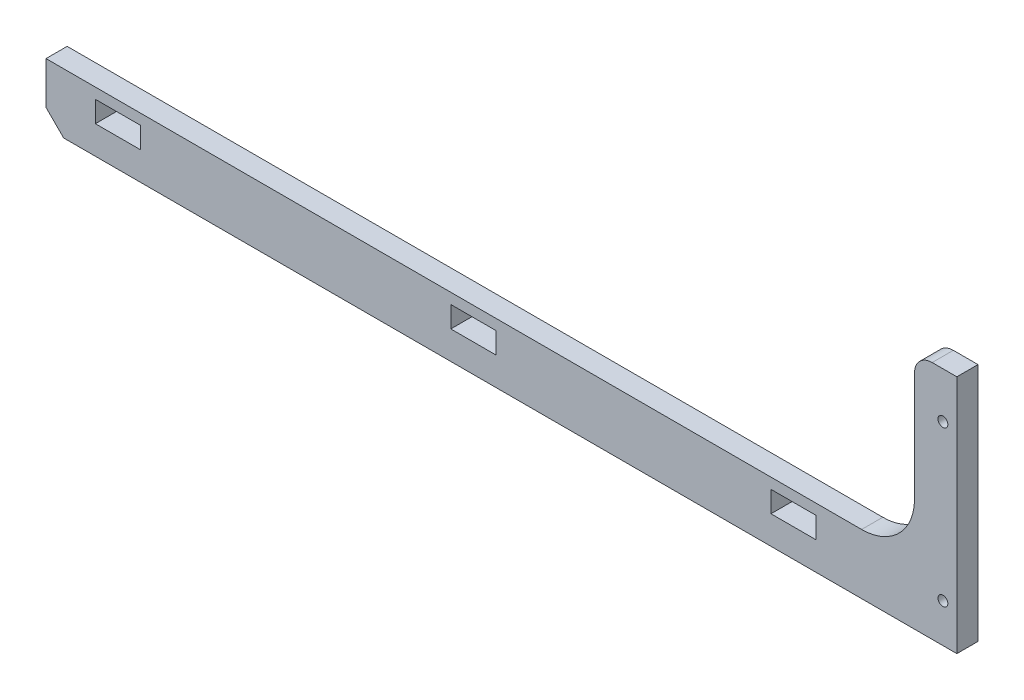
ISO-10303-21;
HEADER;
FILE_DESCRIPTION(('STEP AP214'),'2;1');
FILE_NAME('part.step','',(''),(''),'','','');
FILE_SCHEMA(('AUTOMOTIVE_DESIGN { 1 0 10303 214 1 1 1 1 }'));
ENDSEC;
DATA;
#1=APPLICATION_CONTEXT('core data for automotive mechanical design processes');
#2=APPLICATION_PROTOCOL_DEFINITION('international standard','automotive_design',2000,#1);
#3=PRODUCT_CONTEXT('',#1,'mechanical');
#4=PRODUCT('Part','Part','',(#3));
#5=PRODUCT_RELATED_PRODUCT_CATEGORY('part','',(#4));
#6=PRODUCT_DEFINITION_FORMATION('','',#4);
#7=PRODUCT_DEFINITION_CONTEXT('part definition',#1,'design');
#8=PRODUCT_DEFINITION('design','',#6,#7);
#9=PRODUCT_DEFINITION_SHAPE('','',#8);
#10=(LENGTH_UNIT() NAMED_UNIT(*) SI_UNIT(.MILLI.,.METRE.));
#11=(NAMED_UNIT(*) PLANE_ANGLE_UNIT() SI_UNIT($,.RADIAN.));
#12=(NAMED_UNIT(*) SI_UNIT($,.STERADIAN.) SOLID_ANGLE_UNIT());
#13=UNCERTAINTY_MEASURE_WITH_UNIT(LENGTH_MEASURE(1.E-05),#10,'distance_accuracy_value','');
#14=(GEOMETRIC_REPRESENTATION_CONTEXT(3) GLOBAL_UNCERTAINTY_ASSIGNED_CONTEXT((#13)) GLOBAL_UNIT_ASSIGNED_CONTEXT((#10,
#11,#12)) REPRESENTATION_CONTEXT('',''));
#15=CARTESIAN_POINT('',(0.,0.,0.));
#16=DIRECTION('',(0.,0.,1.));
#17=DIRECTION('',(1.,0.,0.));
#18=AXIS2_PLACEMENT_3D('',#15,#16,#17);
#19=CARTESIAN_POINT('',(84.1274333563427,52.,6.));
#20=DIRECTION('',(0.,0.,1.));
#21=DIRECTION('',(1.,0.,0.));
#22=AXIS2_PLACEMENT_3D('',#19,#20,#21);
#23=PLANE('',#22);
#24=CARTESIAN_POINT('',(87.1774333563427,0.,6.));
#25=DIRECTION('',(0.,0.,1.));
#26=DIRECTION('',(1.,0.,0.));
#27=AXIS2_PLACEMENT_3D('',#24,#25,#26);
#28=CIRCLE('',#27,1.4);
#29=CARTESIAN_POINT('',(88.5774333563427,0.,6.));
#30=VERTEX_POINT('',#29);
#31=EDGE_CURVE('E207',#30,#30,#28,.T.);
#32=ORIENTED_EDGE('',*,*,#31,.F.);
#33=EDGE_LOOP('',(#32));
#34=FACE_BOUND('',#33,.T.);
#35=DIRECTION('',(1.,0.,0.));
#36=VECTOR('',#35,1.);
#37=CARTESIAN_POINT('',(-162.182566643657,-11.,6.));
#38=LINE('',#37,#36);
#39=CARTESIAN_POINT('',(-162.182566643657,-11.,6.));
#40=VERTEX_POINT('',#39);
#41=CARTESIAN_POINT('',(91.1274333563427,-11.,6.));
#42=VERTEX_POINT('',#41);
#43=EDGE_CURVE('E279',#40,#42,#38,.T.);
#44=ORIENTED_EDGE('',*,*,#43,.T.);
#45=DIRECTION('',(0.,1.,0.));
#46=VECTOR('',#45,1.);
#47=CARTESIAN_POINT('',(91.1274333563427,6.,6.));
#48=LINE('',#47,#46);
#49=CARTESIAN_POINT('',(91.1274333563427,57.,6.));
#50=VERTEX_POINT('',#49);
#51=EDGE_CURVE('E282',#42,#50,#48,.T.);
#52=ORIENTED_EDGE('',*,*,#51,.T.);
#53=DIRECTION('',(-1.,0.,0.));
#54=VECTOR('',#53,1.);
#55=CARTESIAN_POINT('',(91.1274333563427,57.,6.));
#56=LINE('',#55,#54);
#57=CARTESIAN_POINT('',(84.1274333563427,57.,6.));
#58=VERTEX_POINT('',#57);
#59=EDGE_CURVE('E285',#50,#58,#56,.T.);
#60=ORIENTED_EDGE('',*,*,#59,.T.);
#61=CARTESIAN_POINT('',(84.1274333563427,52.,6.));
#62=DIRECTION('',(0.,0.,1.));
#63=DIRECTION('',(1.,0.,0.));
#64=AXIS2_PLACEMENT_3D('',#61,#62,#63);
#65=CIRCLE('',#64,5.);
#66=CARTESIAN_POINT('',(79.1274333563427,52.,6.));
#67=VERTEX_POINT('',#66);
#68=EDGE_CURVE('E287',#58,#67,#65,.T.);
#69=ORIENTED_EDGE('',*,*,#68,.T.);
#70=DIRECTION('',(0.,-1.,0.));
#71=VECTOR('',#70,1.);
#72=CARTESIAN_POINT('',(79.1274333563427,52.,6.));
#73=LINE('',#72,#71);
#74=CARTESIAN_POINT('',(79.1274333563427,21.0000000000001,6.));
#75=VERTEX_POINT('',#74);
#76=EDGE_CURVE('E289',#67,#75,#73,.T.);
#77=ORIENTED_EDGE('',*,*,#76,.T.);
#78=CARTESIAN_POINT('',(64.1274333563427,21.,6.));
#79=DIRECTION('',(0.,0.,-1.));
#80=DIRECTION('',(-1.,0.,0.));
#81=AXIS2_PLACEMENT_3D('',#78,#79,#80);
#82=CIRCLE('',#81,15.);
#83=CARTESIAN_POINT('',(64.1274333563426,6.,6.));
#84=VERTEX_POINT('',#83);
#85=EDGE_CURVE('E291',#75,#84,#82,.T.);
#86=ORIENTED_EDGE('',*,*,#85,.T.);
#87=DIRECTION('',(-1.,0.,0.));
#88=VECTOR('',#87,1.);
#89=CARTESIAN_POINT('',(-167.182566643657,6.,6.));
#90=LINE('',#89,#88);
#91=CARTESIAN_POINT('',(-167.182566643657,6.,6.));
#92=VERTEX_POINT('',#91);
#93=EDGE_CURVE('E293',#84,#92,#90,.T.);
#94=ORIENTED_EDGE('',*,*,#93,.T.);
#95=DIRECTION('',(0.,-1.,0.));
#96=VECTOR('',#95,1.);
#97=CARTESIAN_POINT('',(-167.182566643657,6.,6.));
#98=LINE('',#97,#96);
#99=CARTESIAN_POINT('',(-167.182566643657,-6.,6.));
#100=VERTEX_POINT('',#99);
#101=EDGE_CURVE('E295',#92,#100,#98,.T.);
#102=ORIENTED_EDGE('',*,*,#101,.T.);
#103=DIRECTION('',(0.707106781186548,-0.707106781186547,0.));
#104=VECTOR('',#103,1.);
#105=CARTESIAN_POINT('',(-167.182566643657,-6.,6.));
#106=LINE('',#105,#104);
#107=EDGE_CURVE('E297',#100,#40,#106,.T.);
#108=ORIENTED_EDGE('',*,*,#107,.T.);
#109=EDGE_LOOP('',(#44,#52,#60,#69,#77,#86,#94,#102,#108));
#110=FACE_BOUND('',#109,.T.);
#111=DIRECTION('',(-1.,0.,0.));
#112=VECTOR('',#111,1.);
#113=CARTESIAN_POINT('',(38.4174333563427,3.,6.));
#114=LINE('',#113,#112);
#115=CARTESIAN_POINT('',(51.2174333563427,3.,6.));
#116=VERTEX_POINT('',#115);
#117=CARTESIAN_POINT('',(38.4174333563427,3.,6.));
#118=VERTEX_POINT('',#117);
#119=EDGE_CURVE('E250',#116,#118,#114,.T.);
#120=ORIENTED_EDGE('',*,*,#119,.F.);
#121=DIRECTION('',(0.,1.,0.));
#122=VECTOR('',#121,1.);
#123=CARTESIAN_POINT('',(51.2174333563427,3.,6.));
#124=LINE('',#123,#122);
#125=CARTESIAN_POINT('',(51.2174333563427,-3.,6.));
#126=VERTEX_POINT('',#125);
#127=EDGE_CURVE('E248',#126,#116,#124,.T.);
#128=ORIENTED_EDGE('',*,*,#127,.F.);
#129=DIRECTION('',(1.,0.,0.));
#130=VECTOR('',#129,1.);
#131=CARTESIAN_POINT('',(38.4174333563427,-3.,6.));
#132=LINE('',#131,#130);
#133=CARTESIAN_POINT('',(38.4174333563427,-3.,6.));
#134=VERTEX_POINT('',#133);
#135=EDGE_CURVE('E256',#134,#126,#132,.T.);
#136=ORIENTED_EDGE('',*,*,#135,.F.);
#137=DIRECTION('',(0.,-1.,0.));
#138=VECTOR('',#137,1.);
#139=CARTESIAN_POINT('',(38.4174333563427,3.,6.));
#140=LINE('',#139,#138);
#141=EDGE_CURVE('E253',#118,#134,#140,.T.);
#142=ORIENTED_EDGE('',*,*,#141,.F.);
#143=EDGE_LOOP('',(#120,#128,#136,#142));
#144=FACE_BOUND('',#143,.T.);
#145=DIRECTION('',(-1.,0.,0.));
#146=VECTOR('',#145,1.);
#147=CARTESIAN_POINT('',(-52.3825666436573,3.,6.));
#148=LINE('',#147,#146);
#149=CARTESIAN_POINT('',(-39.5825666436573,3.,6.));
#150=VERTEX_POINT('',#149);
#151=CARTESIAN_POINT('',(-52.3825666436573,3.,6.));
#152=VERTEX_POINT('',#151);
#153=EDGE_CURVE('E219',#150,#152,#148,.T.);
#154=ORIENTED_EDGE('',*,*,#153,.F.);
#155=DIRECTION('',(0.,1.,0.));
#156=VECTOR('',#155,1.);
#157=CARTESIAN_POINT('',(-39.5825666436573,3.,6.));
#158=LINE('',#157,#156);
#159=CARTESIAN_POINT('',(-39.5825666436573,-3.,6.));
#160=VERTEX_POINT('',#159);
#161=EDGE_CURVE('E217',#160,#150,#158,.T.);
#162=ORIENTED_EDGE('',*,*,#161,.F.);
#163=DIRECTION('',(1.,0.,0.));
#164=VECTOR('',#163,1.);
#165=CARTESIAN_POINT('',(-52.3825666436573,-3.,6.));
#166=LINE('',#165,#164);
#167=CARTESIAN_POINT('',(-52.3825666436573,-3.,6.));
#168=VERTEX_POINT('',#167);
#169=EDGE_CURVE('E225',#168,#160,#166,.T.);
#170=ORIENTED_EDGE('',*,*,#169,.F.);
#171=DIRECTION('',(0.,-1.,0.));
#172=VECTOR('',#171,1.);
#173=CARTESIAN_POINT('',(-52.3825666436573,3.,6.));
#174=LINE('',#173,#172);
#175=EDGE_CURVE('E222',#152,#168,#174,.T.);
#176=ORIENTED_EDGE('',*,*,#175,.F.);
#177=EDGE_LOOP('',(#154,#162,#170,#176));
#178=FACE_BOUND('',#177,.T.);
#179=DIRECTION('',(-1.,0.,0.));
#180=VECTOR('',#179,1.);
#181=CARTESIAN_POINT('',(-153.182566643657,3.,6.));
#182=LINE('',#181,#180);
#183=CARTESIAN_POINT('',(-140.382566643657,3.,6.));
#184=VERTEX_POINT('',#183);
#185=CARTESIAN_POINT('',(-153.182566643657,3.,6.));
#186=VERTEX_POINT('',#185);
#187=EDGE_CURVE('E186',#184,#186,#182,.T.);
#188=ORIENTED_EDGE('',*,*,#187,.F.);
#189=DIRECTION('',(0.,1.,0.));
#190=VECTOR('',#189,1.);
#191=CARTESIAN_POINT('',(-140.382566643657,3.,6.));
#192=LINE('',#191,#190);
#193=CARTESIAN_POINT('',(-140.382566643657,-3.,6.));
#194=VERTEX_POINT('',#193);
#195=EDGE_CURVE('E178',#194,#184,#192,.T.);
#196=ORIENTED_EDGE('',*,*,#195,.F.);
#197=DIRECTION('',(1.,0.,0.));
#198=VECTOR('',#197,1.);
#199=CARTESIAN_POINT('',(-153.182566643657,-3.,6.));
#200=LINE('',#199,#198);
#201=CARTESIAN_POINT('',(-153.182566643657,-3.,6.));
#202=VERTEX_POINT('',#201);
#203=EDGE_CURVE('E201',#202,#194,#200,.T.);
#204=ORIENTED_EDGE('',*,*,#203,.F.);
#205=DIRECTION('',(0.,-1.,0.));
#206=VECTOR('',#205,1.);
#207=CARTESIAN_POINT('',(-153.182566643657,3.,6.));
#208=LINE('',#207,#206);
#209=EDGE_CURVE('E199',#186,#202,#208,.T.);
#210=ORIENTED_EDGE('',*,*,#209,.F.);
#211=EDGE_LOOP('',(#188,#196,#204,#210));
#212=FACE_BOUND('',#211,.T.);
#213=CARTESIAN_POINT('',(87.1774333563427,44.,6.));
#214=DIRECTION('',(0.,0.,1.));
#215=DIRECTION('',(1.,0.,0.));
#216=AXIS2_PLACEMENT_3D('',#213,#214,#215);
#217=CIRCLE('',#216,1.4);
#218=CARTESIAN_POINT('',(88.5774333563427,44.,6.));
#219=VERTEX_POINT('',#218);
#220=EDGE_CURVE('E620',#219,#219,#217,.T.);
#221=ORIENTED_EDGE('',*,*,#220,.F.);
#222=EDGE_LOOP('',(#221));
#223=FACE_BOUND('',#222,.T.);
#224=ADVANCED_FACE('F35',(#34,#110,#144,#178,#212,#223),#23,.T.);
#225=CARTESIAN_POINT('',(84.1274333563427,52.,0.));
#226=DIRECTION('',(0.,0.,1.));
#227=DIRECTION('',(1.,0.,0.));
#228=AXIS2_PLACEMENT_3D('',#225,#226,#227);
#229=PLANE('',#228);
#230=DIRECTION('',(0.,1.,0.));
#231=VECTOR('',#230,1.);
#232=CARTESIAN_POINT('',(-39.5825666436573,3.,0.));
#233=LINE('',#232,#231);
#234=CARTESIAN_POINT('',(-39.5825666436573,-3.,0.));
#235=VERTEX_POINT('',#234);
#236=CARTESIAN_POINT('',(-39.5825666436573,3.,0.));
#237=VERTEX_POINT('',#236);
#238=EDGE_CURVE('E194',#235,#237,#233,.T.);
#239=ORIENTED_EDGE('',*,*,#238,.T.);
#240=DIRECTION('',(-1.,0.,0.));
#241=VECTOR('',#240,1.);
#242=CARTESIAN_POINT('',(-52.3825666436573,3.,0.));
#243=LINE('',#242,#241);
#244=CARTESIAN_POINT('',(-52.3825666436573,3.,0.));
#245=VERTEX_POINT('',#244);
#246=EDGE_CURVE('E230',#237,#245,#243,.T.);
#247=ORIENTED_EDGE('',*,*,#246,.T.);
#248=DIRECTION('',(0.,-1.,0.));
#249=VECTOR('',#248,1.);
#250=CARTESIAN_POINT('',(-52.3825666436573,3.,0.));
#251=LINE('',#250,#249);
#252=CARTESIAN_POINT('',(-52.3825666436573,-3.,0.));
#253=VERTEX_POINT('',#252);
#254=EDGE_CURVE('E233',#245,#253,#251,.T.);
#255=ORIENTED_EDGE('',*,*,#254,.T.);
#256=DIRECTION('',(1.,0.,0.));
#257=VECTOR('',#256,1.);
#258=CARTESIAN_POINT('',(-52.3825666436573,-3.,0.));
#259=LINE('',#258,#257);
#260=EDGE_CURVE('E220',#253,#235,#259,.T.);
#261=ORIENTED_EDGE('',*,*,#260,.T.);
#262=EDGE_LOOP('',(#239,#247,#255,#261));
#263=FACE_BOUND('',#262,.T.);
#264=DIRECTION('',(1.,0.,0.));
#265=VECTOR('',#264,1.);
#266=CARTESIAN_POINT('',(-162.182566643657,-11.,0.));
#267=LINE('',#266,#265);
#268=CARTESIAN_POINT('',(-162.182566643657,-11.,0.));
#269=VERTEX_POINT('',#268);
#270=CARTESIAN_POINT('',(91.1274333563427,-11.,0.));
#271=VERTEX_POINT('',#270);
#272=EDGE_CURVE('E278',#269,#271,#267,.T.);
#273=ORIENTED_EDGE('',*,*,#272,.F.);
#274=DIRECTION('',(0.707106781186548,-0.707106781186547,0.));
#275=VECTOR('',#274,1.);
#276=CARTESIAN_POINT('',(-167.182566643657,-6.,0.));
#277=LINE('',#276,#275);
#278=CARTESIAN_POINT('',(-167.182566643657,-6.,0.));
#279=VERTEX_POINT('',#278);
#280=EDGE_CURVE('E283',#279,#269,#277,.T.);
#281=ORIENTED_EDGE('',*,*,#280,.F.);
#282=DIRECTION('',(0.,-1.,0.));
#283=VECTOR('',#282,1.);
#284=CARTESIAN_POINT('',(-167.182566643657,6.,0.));
#285=LINE('',#284,#283);
#286=CARTESIAN_POINT('',(-167.182566643657,6.,0.));
#287=VERTEX_POINT('',#286);
#288=EDGE_CURVE('E315',#287,#279,#285,.T.);
#289=ORIENTED_EDGE('',*,*,#288,.F.);
#290=DIRECTION('',(-1.,0.,0.));
#291=VECTOR('',#290,1.);
#292=CARTESIAN_POINT('',(-167.182566643657,6.,0.));
#293=LINE('',#292,#291);
#294=CARTESIAN_POINT('',(64.1274333563426,6.,0.));
#295=VERTEX_POINT('',#294);
#296=EDGE_CURVE('E313',#295,#287,#293,.T.);
#297=ORIENTED_EDGE('',*,*,#296,.F.);
#298=CARTESIAN_POINT('',(64.1274333563427,21.,0.));
#299=DIRECTION('',(0.,0.,-1.));
#300=DIRECTION('',(-1.,0.,0.));
#301=AXIS2_PLACEMENT_3D('',#298,#299,#300);
#302=CIRCLE('',#301,15.);
#303=CARTESIAN_POINT('',(79.1274333563427,21.0000000000001,0.));
#304=VERTEX_POINT('',#303);
#305=EDGE_CURVE('E311',#304,#295,#302,.T.);
#306=ORIENTED_EDGE('',*,*,#305,.F.);
#307=DIRECTION('',(0.,-1.,0.));
#308=VECTOR('',#307,1.);
#309=CARTESIAN_POINT('',(79.1274333563427,44.,0.));
#310=LINE('',#309,#308);
#311=CARTESIAN_POINT('',(79.1274333563427,52.,0.));
#312=VERTEX_POINT('',#311);
#313=EDGE_CURVE('E309',#312,#304,#310,.T.);
#314=ORIENTED_EDGE('',*,*,#313,.F.);
#315=CARTESIAN_POINT('',(84.1274333563427,52.,0.));
#316=DIRECTION('',(0.,0.,1.));
#317=DIRECTION('',(1.,0.,0.));
#318=AXIS2_PLACEMENT_3D('',#315,#316,#317);
#319=CIRCLE('',#318,5.);
#320=CARTESIAN_POINT('',(84.1274333563427,57.,0.));
#321=VERTEX_POINT('',#320);
#322=EDGE_CURVE('E306',#321,#312,#319,.T.);
#323=ORIENTED_EDGE('',*,*,#322,.F.);
#324=DIRECTION('',(-1.,0.,0.));
#325=VECTOR('',#324,1.);
#326=CARTESIAN_POINT('',(91.1274333563427,57.,0.));
#327=LINE('',#326,#325);
#328=CARTESIAN_POINT('',(91.1274333563427,57.,0.));
#329=VERTEX_POINT('',#328);
#330=EDGE_CURVE('E304',#329,#321,#327,.T.);
#331=ORIENTED_EDGE('',*,*,#330,.F.);
#332=DIRECTION('',(0.,1.,0.));
#333=VECTOR('',#332,1.);
#334=CARTESIAN_POINT('',(91.1274333563427,49.,0.));
#335=LINE('',#334,#333);
#336=EDGE_CURVE('E302',#271,#329,#335,.T.);
#337=ORIENTED_EDGE('',*,*,#336,.F.);
#338=EDGE_LOOP('',(#273,#281,#289,#297,#306,#314,#323,#331,#337));
#339=FACE_BOUND('',#338,.T.);
#340=DIRECTION('',(0.,1.,0.));
#341=VECTOR('',#340,1.);
#342=CARTESIAN_POINT('',(51.2174333563427,3.,0.));
#343=LINE('',#342,#341);
#344=CARTESIAN_POINT('',(51.2174333563427,-3.,0.));
#345=VERTEX_POINT('',#344);
#346=CARTESIAN_POINT('',(51.2174333563427,3.,0.));
#347=VERTEX_POINT('',#346);
#348=EDGE_CURVE('E247',#345,#347,#343,.T.);
#349=ORIENTED_EDGE('',*,*,#348,.T.);
#350=DIRECTION('',(-1.,0.,0.));
#351=VECTOR('',#350,1.);
#352=CARTESIAN_POINT('',(38.4174333563427,3.,0.));
#353=LINE('',#352,#351);
#354=CARTESIAN_POINT('',(38.4174333563427,3.,0.));
#355=VERTEX_POINT('',#354);
#356=EDGE_CURVE('E261',#347,#355,#353,.T.);
#357=ORIENTED_EDGE('',*,*,#356,.T.);
#358=DIRECTION('',(0.,-1.,0.));
#359=VECTOR('',#358,1.);
#360=CARTESIAN_POINT('',(38.4174333563427,3.,0.));
#361=LINE('',#360,#359);
#362=CARTESIAN_POINT('',(38.4174333563427,-3.,0.));
#363=VERTEX_POINT('',#362);
#364=EDGE_CURVE('E264',#355,#363,#361,.T.);
#365=ORIENTED_EDGE('',*,*,#364,.T.);
#366=DIRECTION('',(1.,0.,0.));
#367=VECTOR('',#366,1.);
#368=CARTESIAN_POINT('',(38.4174333563427,-3.,0.));
#369=LINE('',#368,#367);
#370=EDGE_CURVE('E251',#363,#345,#369,.T.);
#371=ORIENTED_EDGE('',*,*,#370,.T.);
#372=EDGE_LOOP('',(#349,#357,#365,#371));
#373=FACE_BOUND('',#372,.T.);
#374=DIRECTION('',(0.,1.,0.));
#375=VECTOR('',#374,1.);
#376=CARTESIAN_POINT('',(-140.382566643657,3.,0.));
#377=LINE('',#376,#375);
#378=CARTESIAN_POINT('',(-140.382566643657,-3.,0.));
#379=VERTEX_POINT('',#378);
#380=CARTESIAN_POINT('',(-140.382566643657,3.,0.));
#381=VERTEX_POINT('',#380);
#382=EDGE_CURVE('E58',#379,#381,#377,.T.);
#383=ORIENTED_EDGE('',*,*,#382,.T.);
#384=DIRECTION('',(-1.,0.,0.));
#385=VECTOR('',#384,1.);
#386=CARTESIAN_POINT('',(-153.182566643657,3.,0.));
#387=LINE('',#386,#385);
#388=CARTESIAN_POINT('',(-153.182566643657,3.,0.));
#389=VERTEX_POINT('',#388);
#390=EDGE_CURVE('E193',#381,#389,#387,.T.);
#391=ORIENTED_EDGE('',*,*,#390,.T.);
#392=DIRECTION('',(0.,-1.,0.));
#393=VECTOR('',#392,1.);
#394=CARTESIAN_POINT('',(-153.182566643657,3.,0.));
#395=LINE('',#394,#393);
#396=CARTESIAN_POINT('',(-153.182566643657,-3.,0.));
#397=VERTEX_POINT('',#396);
#398=EDGE_CURVE('E209',#389,#397,#395,.T.);
#399=ORIENTED_EDGE('',*,*,#398,.T.);
#400=DIRECTION('',(1.,0.,0.));
#401=VECTOR('',#400,1.);
#402=CARTESIAN_POINT('',(-153.182566643657,-3.,0.));
#403=LINE('',#402,#401);
#404=EDGE_CURVE('E187',#397,#379,#403,.T.);
#405=ORIENTED_EDGE('',*,*,#404,.T.);
#406=EDGE_LOOP('',(#383,#391,#399,#405));
#407=FACE_BOUND('',#406,.T.);
#408=CARTESIAN_POINT('',(87.1774333563427,0.,0.));
#409=DIRECTION('',(0.,0.,1.));
#410=DIRECTION('',(1.,0.,0.));
#411=AXIS2_PLACEMENT_3D('',#408,#409,#410);
#412=CIRCLE('',#411,1.4);
#413=CARTESIAN_POINT('',(88.5774333563427,0.,0.));
#414=VERTEX_POINT('',#413);
#415=EDGE_CURVE('E626',#414,#414,#412,.T.);
#416=ORIENTED_EDGE('',*,*,#415,.T.);
#417=EDGE_LOOP('',(#416));
#418=FACE_BOUND('',#417,.T.);
#419=CARTESIAN_POINT('',(87.1774333563427,44.,0.));
#420=DIRECTION('',(0.,0.,1.));
#421=DIRECTION('',(1.,0.,0.));
#422=AXIS2_PLACEMENT_3D('',#419,#420,#421);
#423=CIRCLE('',#422,1.4);
#424=CARTESIAN_POINT('',(88.5774333563427,44.,0.));
#425=VERTEX_POINT('',#424);
#426=EDGE_CURVE('E623',#425,#425,#423,.T.);
#427=ORIENTED_EDGE('',*,*,#426,.T.);
#428=EDGE_LOOP('',(#427));
#429=FACE_BOUND('',#428,.T.);
#430=ADVANCED_FACE('F348',(#263,#339,#373,#407,#418,#429),#229,.F.);
#431=CARTESIAN_POINT('',(-162.182566643657,-11.,6.));
#432=DIRECTION('',(0.,1.,0.));
#433=DIRECTION('',(-1.,0.,0.));
#434=AXIS2_PLACEMENT_3D('',#431,#432,#433);
#435=PLANE('',#434);
#436=ORIENTED_EDGE('',*,*,#272,.T.);
#437=DIRECTION('',(0.,0.,-1.));
#438=VECTOR('',#437,1.);
#439=CARTESIAN_POINT('',(91.1274333563427,-11.,6.));
#440=LINE('',#439,#438);
#441=EDGE_CURVE('E11',#42,#271,#440,.T.);
#442=ORIENTED_EDGE('',*,*,#441,.F.);
#443=ORIENTED_EDGE('',*,*,#43,.F.);
#444=DIRECTION('',(0.,0.,-1.));
#445=VECTOR('',#444,1.);
#446=CARTESIAN_POINT('',(-162.182566643657,-11.,6.));
#447=LINE('',#446,#445);
#448=EDGE_CURVE('E299',#40,#269,#447,.T.);
#449=ORIENTED_EDGE('',*,*,#448,.T.);
#450=EDGE_LOOP('',(#436,#442,#443,#449));
#451=FACE_BOUND('',#450,.T.);
#452=ADVANCED_FACE('F37',(#451),#435,.F.);
#453=CARTESIAN_POINT('',(91.1274333563427,49.,6.));
#454=DIRECTION('',(-1.,0.,0.));
#455=DIRECTION('',(0.,0.,1.));
#456=AXIS2_PLACEMENT_3D('',#453,#454,#455);
#457=PLANE('',#456);
#458=ORIENTED_EDGE('',*,*,#336,.T.);
#459=DIRECTION('',(0.,0.,-1.));
#460=VECTOR('',#459,1.);
#461=CARTESIAN_POINT('',(91.1274333563427,57.,6.));
#462=LINE('',#461,#460);
#463=EDGE_CURVE('E43',#50,#329,#462,.T.);
#464=ORIENTED_EDGE('',*,*,#463,.F.);
#465=ORIENTED_EDGE('',*,*,#51,.F.);
#466=ORIENTED_EDGE('',*,*,#441,.T.);
#467=EDGE_LOOP('',(#458,#464,#465,#466));
#468=FACE_BOUND('',#467,.T.);
#469=ADVANCED_FACE('F365',(#468),#457,.F.);
#470=CARTESIAN_POINT('',(91.1274333563427,57.,6.));
#471=DIRECTION('',(0.,-1.,0.));
#472=DIRECTION('',(0.,0.,-1.));
#473=AXIS2_PLACEMENT_3D('',#470,#471,#472);
#474=PLANE('',#473);
#475=ORIENTED_EDGE('',*,*,#330,.T.);
#476=DIRECTION('',(0.,0.,-1.));
#477=VECTOR('',#476,1.);
#478=CARTESIAN_POINT('',(84.1274333563427,57.,6.));
#479=LINE('',#478,#477);
#480=EDGE_CURVE('E335',#58,#321,#479,.T.);
#481=ORIENTED_EDGE('',*,*,#480,.F.);
#482=ORIENTED_EDGE('',*,*,#59,.F.);
#483=ORIENTED_EDGE('',*,*,#463,.T.);
#484=EDGE_LOOP('',(#475,#481,#482,#483));
#485=FACE_BOUND('',#484,.T.);
#486=ADVANCED_FACE('F342',(#485),#474,.F.);
#487=CARTESIAN_POINT('',(84.1274333563427,52.,6.));
#488=DIRECTION('',(0.,0.,-1.));
#489=DIRECTION('',(-1.,0.,0.));
#490=AXIS2_PLACEMENT_3D('',#487,#488,#489);
#491=CYLINDRICAL_SURFACE('',#490,5.);
#492=ORIENTED_EDGE('',*,*,#322,.T.);
#493=DIRECTION('',(0.,0.,-1.));
#494=VECTOR('',#493,1.);
#495=CARTESIAN_POINT('',(79.1274333563427,52.,6.));
#496=LINE('',#495,#494);
#497=EDGE_CURVE('E332',#67,#312,#496,.T.);
#498=ORIENTED_EDGE('',*,*,#497,.F.);
#499=ORIENTED_EDGE('',*,*,#68,.F.);
#500=ORIENTED_EDGE('',*,*,#480,.T.);
#501=EDGE_LOOP('',(#492,#498,#499,#500));
#502=FACE_BOUND('',#501,.T.);
#503=ADVANCED_FACE('F353',(#502),#491,.T.);
#504=CARTESIAN_POINT('',(79.1274333563427,44.,6.));
#505=DIRECTION('',(1.,0.,0.));
#506=DIRECTION('',(0.,0.,-1.));
#507=AXIS2_PLACEMENT_3D('',#504,#505,#506);
#508=PLANE('',#507);
#509=ORIENTED_EDGE('',*,*,#313,.T.);
#510=DIRECTION('',(0.,0.,-1.));
#511=VECTOR('',#510,1.);
#512=CARTESIAN_POINT('',(79.1274333563427,21.0000000000001,6.));
#513=LINE('',#512,#511);
#514=EDGE_CURVE('E329',#75,#304,#513,.T.);
#515=ORIENTED_EDGE('',*,*,#514,.F.);
#516=ORIENTED_EDGE('',*,*,#76,.F.);
#517=ORIENTED_EDGE('',*,*,#497,.T.);
#518=EDGE_LOOP('',(#509,#515,#516,#517));
#519=FACE_BOUND('',#518,.T.);
#520=ADVANCED_FACE('F357',(#519),#508,.F.);
#521=CARTESIAN_POINT('',(64.1274333563427,21.,6.));
#522=DIRECTION('',(0.,0.,-1.));
#523=DIRECTION('',(-1.,0.,0.));
#524=AXIS2_PLACEMENT_3D('',#521,#522,#523);
#525=CYLINDRICAL_SURFACE('',#524,15.);
#526=ORIENTED_EDGE('',*,*,#305,.T.);
#527=DIRECTION('',(0.,0.,-1.));
#528=VECTOR('',#527,1.);
#529=CARTESIAN_POINT('',(64.1274333563426,6.,6.));
#530=LINE('',#529,#528);
#531=EDGE_CURVE('E326',#84,#295,#530,.T.);
#532=ORIENTED_EDGE('',*,*,#531,.F.);
#533=ORIENTED_EDGE('',*,*,#85,.F.);
#534=ORIENTED_EDGE('',*,*,#514,.T.);
#535=EDGE_LOOP('',(#526,#532,#533,#534));
#536=FACE_BOUND('',#535,.T.);
#537=ADVANCED_FACE('F383',(#536),#525,.F.);
#538=CARTESIAN_POINT('',(-167.182566643657,6.,6.));
#539=DIRECTION('',(0.,-1.,0.));
#540=DIRECTION('',(1.,0.,0.));
#541=AXIS2_PLACEMENT_3D('',#538,#539,#540);
#542=PLANE('',#541);
#543=ORIENTED_EDGE('',*,*,#296,.T.);
#544=DIRECTION('',(0.,0.,-1.));
#545=VECTOR('',#544,1.);
#546=CARTESIAN_POINT('',(-167.182566643657,6.,6.));
#547=LINE('',#546,#545);
#548=EDGE_CURVE('E323',#92,#287,#547,.T.);
#549=ORIENTED_EDGE('',*,*,#548,.F.);
#550=ORIENTED_EDGE('',*,*,#93,.F.);
#551=ORIENTED_EDGE('',*,*,#531,.T.);
#552=EDGE_LOOP('',(#543,#549,#550,#551));
#553=FACE_BOUND('',#552,.T.);
#554=ADVANCED_FACE('F381',(#553),#542,.F.);
#555=CARTESIAN_POINT('',(-167.182566643657,6.,6.));
#556=DIRECTION('',(1.,0.,0.));
#557=DIRECTION('',(0.,0.,-1.));
#558=AXIS2_PLACEMENT_3D('',#555,#556,#557);
#559=PLANE('',#558);
#560=ORIENTED_EDGE('',*,*,#288,.T.);
#561=DIRECTION('',(0.,0.,-1.));
#562=VECTOR('',#561,1.);
#563=CARTESIAN_POINT('',(-167.182566643657,-6.,6.));
#564=LINE('',#563,#562);
#565=EDGE_CURVE('E320',#100,#279,#564,.T.);
#566=ORIENTED_EDGE('',*,*,#565,.F.);
#567=ORIENTED_EDGE('',*,*,#101,.F.);
#568=ORIENTED_EDGE('',*,*,#548,.T.);
#569=EDGE_LOOP('',(#560,#566,#567,#568));
#570=FACE_BOUND('',#569,.T.);
#571=ADVANCED_FACE('F377',(#570),#559,.F.);
#572=CARTESIAN_POINT('',(-167.182566643657,-6.,6.));
#573=DIRECTION('',(0.707106781186547,0.707106781186548,0.));
#574=DIRECTION('',(-0.707106781186548,0.707106781186547,0.));
#575=AXIS2_PLACEMENT_3D('',#572,#573,#574);
#576=PLANE('',#575);
#577=ORIENTED_EDGE('',*,*,#280,.T.);
#578=ORIENTED_EDGE('',*,*,#448,.F.);
#579=ORIENTED_EDGE('',*,*,#107,.F.);
#580=ORIENTED_EDGE('',*,*,#565,.T.);
#581=EDGE_LOOP('',(#577,#578,#579,#580));
#582=FACE_BOUND('',#581,.T.);
#583=ADVANCED_FACE('F372',(#582),#576,.F.);
#584=CARTESIAN_POINT('',(51.2174333563427,3.,6.));
#585=DIRECTION('',(-1.,0.,0.));
#586=DIRECTION('',(0.,0.,1.));
#587=AXIS2_PLACEMENT_3D('',#584,#585,#586);
#588=PLANE('',#587);
#589=ORIENTED_EDGE('',*,*,#348,.F.);
#590=DIRECTION('',(0.,0.,-1.));
#591=VECTOR('',#590,1.);
#592=CARTESIAN_POINT('',(51.2174333563427,-3.,6.));
#593=LINE('',#592,#591);
#594=EDGE_CURVE('E258',#126,#345,#593,.T.);
#595=ORIENTED_EDGE('',*,*,#594,.F.);
#596=ORIENTED_EDGE('',*,*,#127,.T.);
#597=DIRECTION('',(0.,0.,-1.));
#598=VECTOR('',#597,1.);
#599=CARTESIAN_POINT('',(51.2174333563427,3.,6.));
#600=LINE('',#599,#598);
#601=EDGE_CURVE('E275',#116,#347,#600,.T.);
#602=ORIENTED_EDGE('',*,*,#601,.T.);
#603=EDGE_LOOP('',(#589,#595,#596,#602));
#604=FACE_BOUND('',#603,.T.);
#605=ADVANCED_FACE('F402',(#604),#588,.T.);
#606=CARTESIAN_POINT('',(38.4174333563427,3.,6.));
#607=DIRECTION('',(0.,-1.,0.));
#608=DIRECTION('',(1.,0.,0.));
#609=AXIS2_PLACEMENT_3D('',#606,#607,#608);
#610=PLANE('',#609);
#611=ORIENTED_EDGE('',*,*,#356,.F.);
#612=ORIENTED_EDGE('',*,*,#601,.F.);
#613=ORIENTED_EDGE('',*,*,#119,.T.);
#614=DIRECTION('',(0.,0.,-1.));
#615=VECTOR('',#614,1.);
#616=CARTESIAN_POINT('',(38.4174333563427,3.,6.));
#617=LINE('',#616,#615);
#618=EDGE_CURVE('E273',#118,#355,#617,.T.);
#619=ORIENTED_EDGE('',*,*,#618,.T.);
#620=EDGE_LOOP('',(#611,#612,#613,#619));
#621=FACE_BOUND('',#620,.T.);
#622=ADVANCED_FACE('F422',(#621),#610,.T.);
#623=CARTESIAN_POINT('',(38.4174333563427,3.,6.));
#624=DIRECTION('',(1.,0.,0.));
#625=DIRECTION('',(0.,0.,-1.));
#626=AXIS2_PLACEMENT_3D('',#623,#624,#625);
#627=PLANE('',#626);
#628=ORIENTED_EDGE('',*,*,#364,.F.);
#629=ORIENTED_EDGE('',*,*,#618,.F.);
#630=ORIENTED_EDGE('',*,*,#141,.T.);
#631=DIRECTION('',(0.,0.,-1.));
#632=VECTOR('',#631,1.);
#633=CARTESIAN_POINT('',(38.4174333563427,-3.,6.));
#634=LINE('',#633,#632);
#635=EDGE_CURVE('E271',#134,#363,#634,.T.);
#636=ORIENTED_EDGE('',*,*,#635,.T.);
#637=EDGE_LOOP('',(#628,#629,#630,#636));
#638=FACE_BOUND('',#637,.T.);
#639=ADVANCED_FACE('F429',(#638),#627,.T.);
#640=CARTESIAN_POINT('',(38.4174333563427,-3.,6.));
#641=DIRECTION('',(0.,1.,0.));
#642=DIRECTION('',(0.,0.,1.));
#643=AXIS2_PLACEMENT_3D('',#640,#641,#642);
#644=PLANE('',#643);
#645=ORIENTED_EDGE('',*,*,#370,.F.);
#646=ORIENTED_EDGE('',*,*,#635,.F.);
#647=ORIENTED_EDGE('',*,*,#135,.T.);
#648=ORIENTED_EDGE('',*,*,#594,.T.);
#649=EDGE_LOOP('',(#645,#646,#647,#648));
#650=FACE_BOUND('',#649,.T.);
#651=ADVANCED_FACE('F436',(#650),#644,.T.);
#652=CARTESIAN_POINT('',(-39.5825666436573,3.,6.));
#653=DIRECTION('',(-1.,0.,0.));
#654=DIRECTION('',(0.,0.,1.));
#655=AXIS2_PLACEMENT_3D('',#652,#653,#654);
#656=PLANE('',#655);
#657=ORIENTED_EDGE('',*,*,#238,.F.);
#658=DIRECTION('',(0.,0.,-1.));
#659=VECTOR('',#658,1.);
#660=CARTESIAN_POINT('',(-39.5825666436573,-3.,6.));
#661=LINE('',#660,#659);
#662=EDGE_CURVE('E227',#160,#235,#661,.T.);
#663=ORIENTED_EDGE('',*,*,#662,.F.);
#664=ORIENTED_EDGE('',*,*,#161,.T.);
#665=DIRECTION('',(0.,0.,-1.));
#666=VECTOR('',#665,1.);
#667=CARTESIAN_POINT('',(-39.5825666436573,3.,6.));
#668=LINE('',#667,#666);
#669=EDGE_CURVE('E244',#150,#237,#668,.T.);
#670=ORIENTED_EDGE('',*,*,#669,.T.);
#671=EDGE_LOOP('',(#657,#663,#664,#670));
#672=FACE_BOUND('',#671,.T.);
#673=ADVANCED_FACE('F444',(#672),#656,.T.);
#674=CARTESIAN_POINT('',(-52.3825666436573,3.,6.));
#675=DIRECTION('',(0.,-1.,0.));
#676=DIRECTION('',(0.,0.,-1.));
#677=AXIS2_PLACEMENT_3D('',#674,#675,#676);
#678=PLANE('',#677);
#679=ORIENTED_EDGE('',*,*,#246,.F.);
#680=ORIENTED_EDGE('',*,*,#669,.F.);
#681=ORIENTED_EDGE('',*,*,#153,.T.);
#682=DIRECTION('',(0.,0.,-1.));
#683=VECTOR('',#682,1.);
#684=CARTESIAN_POINT('',(-52.3825666436573,3.,6.));
#685=LINE('',#684,#683);
#686=EDGE_CURVE('E242',#152,#245,#685,.T.);
#687=ORIENTED_EDGE('',*,*,#686,.T.);
#688=EDGE_LOOP('',(#679,#680,#681,#687));
#689=FACE_BOUND('',#688,.T.);
#690=ADVANCED_FACE('F452',(#689),#678,.T.);
#691=CARTESIAN_POINT('',(-52.3825666436573,3.,6.));
#692=DIRECTION('',(1.,0.,0.));
#693=DIRECTION('',(0.,1.,0.));
#694=AXIS2_PLACEMENT_3D('',#691,#692,#693);
#695=PLANE('',#694);
#696=ORIENTED_EDGE('',*,*,#254,.F.);
#697=ORIENTED_EDGE('',*,*,#686,.F.);
#698=ORIENTED_EDGE('',*,*,#175,.T.);
#699=DIRECTION('',(0.,0.,-1.));
#700=VECTOR('',#699,1.);
#701=CARTESIAN_POINT('',(-52.3825666436573,-3.,6.));
#702=LINE('',#701,#700);
#703=EDGE_CURVE('E240',#168,#253,#702,.T.);
#704=ORIENTED_EDGE('',*,*,#703,.T.);
#705=EDGE_LOOP('',(#696,#697,#698,#704));
#706=FACE_BOUND('',#705,.T.);
#707=ADVANCED_FACE('F460',(#706),#695,.T.);
#708=CARTESIAN_POINT('',(-52.3825666436573,-3.,6.));
#709=DIRECTION('',(0.,1.,0.));
#710=DIRECTION('',(0.,0.,1.));
#711=AXIS2_PLACEMENT_3D('',#708,#709,#710);
#712=PLANE('',#711);
#713=ORIENTED_EDGE('',*,*,#260,.F.);
#714=ORIENTED_EDGE('',*,*,#703,.F.);
#715=ORIENTED_EDGE('',*,*,#169,.T.);
#716=ORIENTED_EDGE('',*,*,#662,.T.);
#717=EDGE_LOOP('',(#713,#714,#715,#716));
#718=FACE_BOUND('',#717,.T.);
#719=ADVANCED_FACE('F468',(#718),#712,.T.);
#720=CARTESIAN_POINT('',(-140.382566643657,3.,6.));
#721=DIRECTION('',(-1.,0.,0.));
#722=DIRECTION('',(0.,0.,1.));
#723=AXIS2_PLACEMENT_3D('',#720,#721,#722);
#724=PLANE('',#723);
#725=ORIENTED_EDGE('',*,*,#382,.F.);
#726=DIRECTION('',(0.,0.,-1.));
#727=VECTOR('',#726,1.);
#728=CARTESIAN_POINT('',(-140.382566643657,-3.,6.));
#729=LINE('',#728,#727);
#730=EDGE_CURVE('E182',#194,#379,#729,.T.);
#731=ORIENTED_EDGE('',*,*,#730,.F.);
#732=ORIENTED_EDGE('',*,*,#195,.T.);
#733=DIRECTION('',(0.,0.,-1.));
#734=VECTOR('',#733,1.);
#735=CARTESIAN_POINT('',(-140.382566643657,3.,6.));
#736=LINE('',#735,#734);
#737=EDGE_CURVE('E181',#184,#381,#736,.T.);
#738=ORIENTED_EDGE('',*,*,#737,.T.);
#739=EDGE_LOOP('',(#725,#731,#732,#738));
#740=FACE_BOUND('',#739,.T.);
#741=ADVANCED_FACE('F180',(#740),#724,.T.);
#742=CARTESIAN_POINT('',(-153.182566643657,3.,6.));
#743=DIRECTION('',(0.,-1.,0.));
#744=DIRECTION('',(1.,0.,0.));
#745=AXIS2_PLACEMENT_3D('',#742,#743,#744);
#746=PLANE('',#745);
#747=ORIENTED_EDGE('',*,*,#390,.F.);
#748=ORIENTED_EDGE('',*,*,#737,.F.);
#749=ORIENTED_EDGE('',*,*,#187,.T.);
#750=DIRECTION('',(0.,0.,-1.));
#751=VECTOR('',#750,1.);
#752=CARTESIAN_POINT('',(-153.182566643657,3.,6.));
#753=LINE('',#752,#751);
#754=EDGE_CURVE('E195',#186,#389,#753,.T.);
#755=ORIENTED_EDGE('',*,*,#754,.T.);
#756=EDGE_LOOP('',(#747,#748,#749,#755));
#757=FACE_BOUND('',#756,.T.);
#758=ADVANCED_FACE('F190',(#757),#746,.T.);
#759=CARTESIAN_POINT('',(-153.182566643657,3.,6.));
#760=DIRECTION('',(1.,0.,0.));
#761=DIRECTION('',(0.,0.,-1.));
#762=AXIS2_PLACEMENT_3D('',#759,#760,#761);
#763=PLANE('',#762);
#764=ORIENTED_EDGE('',*,*,#398,.F.);
#765=ORIENTED_EDGE('',*,*,#754,.F.);
#766=ORIENTED_EDGE('',*,*,#209,.T.);
#767=DIRECTION('',(0.,0.,-1.));
#768=VECTOR('',#767,1.);
#769=CARTESIAN_POINT('',(-153.182566643657,-3.,6.));
#770=LINE('',#769,#768);
#771=EDGE_CURVE('E50',#202,#397,#770,.T.);
#772=ORIENTED_EDGE('',*,*,#771,.T.);
#773=EDGE_LOOP('',(#764,#765,#766,#772));
#774=FACE_BOUND('',#773,.T.);
#775=ADVANCED_FACE('F489',(#774),#763,.T.);
#776=CARTESIAN_POINT('',(-153.182566643657,-3.,6.));
#777=DIRECTION('',(0.,1.,0.));
#778=DIRECTION('',(0.,0.,1.));
#779=AXIS2_PLACEMENT_3D('',#776,#777,#778);
#780=PLANE('',#779);
#781=ORIENTED_EDGE('',*,*,#404,.F.);
#782=ORIENTED_EDGE('',*,*,#771,.F.);
#783=ORIENTED_EDGE('',*,*,#203,.T.);
#784=ORIENTED_EDGE('',*,*,#730,.T.);
#785=EDGE_LOOP('',(#781,#782,#783,#784));
#786=FACE_BOUND('',#785,.T.);
#787=ADVANCED_FACE('F496',(#786),#780,.T.);
#788=CARTESIAN_POINT('',(87.1774333563427,0.,6.));
#789=DIRECTION('',(0.,0.,-1.));
#790=DIRECTION('',(-1.,0.,0.));
#791=AXIS2_PLACEMENT_3D('',#788,#789,#790);
#792=CYLINDRICAL_SURFACE('',#791,1.4);
#793=ORIENTED_EDGE('',*,*,#31,.T.);
#794=EDGE_LOOP('',(#793));
#795=FACE_BOUND('',#794,.T.);
#796=ORIENTED_EDGE('',*,*,#415,.F.);
#797=EDGE_LOOP('',(#796));
#798=FACE_BOUND('',#797,.T.);
#799=ADVANCED_FACE('F504',(#795,#798),#792,.F.);
#800=CARTESIAN_POINT('',(87.1774333563427,44.,6.));
#801=DIRECTION('',(0.,0.,-1.));
#802=DIRECTION('',(-1.,0.,0.));
#803=AXIS2_PLACEMENT_3D('',#800,#801,#802);
#804=CYLINDRICAL_SURFACE('',#803,1.4);
#805=ORIENTED_EDGE('',*,*,#220,.T.);
#806=EDGE_LOOP('',(#805));
#807=FACE_BOUND('',#806,.T.);
#808=ORIENTED_EDGE('',*,*,#426,.F.);
#809=EDGE_LOOP('',(#808));
#810=FACE_BOUND('',#809,.T.);
#811=ADVANCED_FACE('F511',(#807,#810),#804,.F.);
#812=CLOSED_SHELL('',(#224,#430,#452,#469,#486,#503,#520,#537,#554,#571,#583,#605,#622,#639,
#651,#673,#690,#707,#719,#741,#758,#775,#787,#799,#811));
#813=MANIFOLD_SOLID_BREP('B2',#812);
#814=ADVANCED_BREP_SHAPE_REPRESENTATION('',(#18,#813),#14);
#815=SHAPE_DEFINITION_REPRESENTATION(#9,#814);
ENDSEC;
END-ISO-10303-21;
